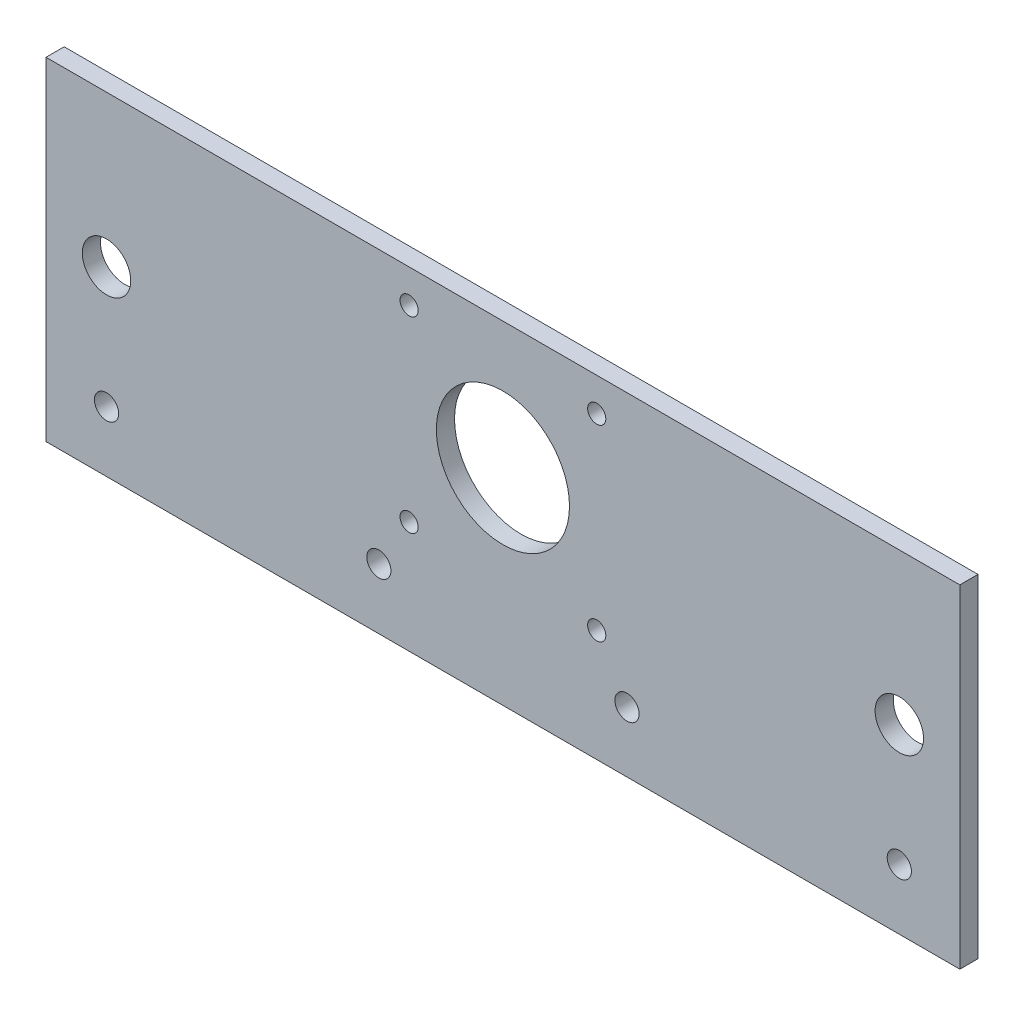
ISO-10303-21;
HEADER;
FILE_DESCRIPTION(('STEP AP214'),'2;1');
FILE_NAME('part.step','',(''),(''),'','','');
FILE_SCHEMA(('AUTOMOTIVE_DESIGN { 1 0 10303 214 1 1 1 1 }'));
ENDSEC;
DATA;
#1=APPLICATION_CONTEXT('core data for automotive mechanical design processes');
#2=APPLICATION_PROTOCOL_DEFINITION('international standard','automotive_design',2000,#1);
#3=PRODUCT_CONTEXT('',#1,'mechanical');
#4=PRODUCT('Part','Part','',(#3));
#5=PRODUCT_RELATED_PRODUCT_CATEGORY('part','',(#4));
#6=PRODUCT_DEFINITION_FORMATION('','',#4);
#7=PRODUCT_DEFINITION_CONTEXT('part definition',#1,'design');
#8=PRODUCT_DEFINITION('design','',#6,#7);
#9=PRODUCT_DEFINITION_SHAPE('','',#8);
#10=(LENGTH_UNIT() NAMED_UNIT(*) SI_UNIT(.MILLI.,.METRE.));
#11=(NAMED_UNIT(*) PLANE_ANGLE_UNIT() SI_UNIT($,.RADIAN.));
#12=(NAMED_UNIT(*) SI_UNIT($,.STERADIAN.) SOLID_ANGLE_UNIT());
#13=UNCERTAINTY_MEASURE_WITH_UNIT(LENGTH_MEASURE(1.E-05),#10,'distance_accuracy_value','');
#14=(GEOMETRIC_REPRESENTATION_CONTEXT(3) GLOBAL_UNCERTAINTY_ASSIGNED_CONTEXT((#13)) GLOBAL_UNIT_ASSIGNED_CONTEXT((#10,
#11,#12)) REPRESENTATION_CONTEXT('',''));
#15=CARTESIAN_POINT('',(0.,0.,0.));
#16=DIRECTION('',(0.,0.,1.));
#17=DIRECTION('',(1.,0.,0.));
#18=AXIS2_PLACEMENT_3D('',#15,#16,#17);
#19=CARTESIAN_POINT('',(0.,0.,3.));
#20=DIRECTION('',(1.,0.,0.));
#21=DIRECTION('',(0.,0.,-1.));
#22=AXIS2_PLACEMENT_3D('',#19,#20,#21);
#23=PLANE('',#22);
#24=DIRECTION('',(0.,-1.,0.));
#25=VECTOR('',#24,1.);
#26=CARTESIAN_POINT('',(0.,0.,0.));
#27=LINE('',#26,#25);
#28=CARTESIAN_POINT('',(0.,55.,0.));
#29=VERTEX_POINT('',#28);
#30=CARTESIAN_POINT('',(0.,0.,0.));
#31=VERTEX_POINT('',#30);
#32=EDGE_CURVE('E98',#29,#31,#27,.T.);
#33=ORIENTED_EDGE('',*,*,#32,.T.);
#34=DIRECTION('',(0.,0.,-1.));
#35=VECTOR('',#34,1.);
#36=CARTESIAN_POINT('',(0.,0.,3.));
#37=LINE('',#36,#35);
#38=CARTESIAN_POINT('',(0.,0.,3.));
#39=VERTEX_POINT('',#38);
#40=EDGE_CURVE('E11',#39,#31,#37,.T.);
#41=ORIENTED_EDGE('',*,*,#40,.F.);
#42=DIRECTION('',(0.,-1.,0.));
#43=VECTOR('',#42,1.);
#44=CARTESIAN_POINT('',(0.,0.,3.));
#45=LINE('',#44,#43);
#46=CARTESIAN_POINT('',(0.,55.,3.));
#47=VERTEX_POINT('',#46);
#48=EDGE_CURVE('E85',#47,#39,#45,.T.);
#49=ORIENTED_EDGE('',*,*,#48,.F.);
#50=DIRECTION('',(0.,0.,-1.));
#51=VECTOR('',#50,1.);
#52=CARTESIAN_POINT('',(0.,55.,3.));
#53=LINE('',#52,#51);
#54=EDGE_CURVE('E94',#47,#29,#53,.T.);
#55=ORIENTED_EDGE('',*,*,#54,.T.);
#56=EDGE_LOOP('',(#33,#41,#49,#55));
#57=FACE_BOUND('',#56,.T.);
#58=ADVANCED_FACE('F32',(#57),#23,.F.);
#59=CARTESIAN_POINT('',(0.,0.,3.));
#60=DIRECTION('',(0.,1.,0.));
#61=DIRECTION('',(0.,0.,1.));
#62=AXIS2_PLACEMENT_3D('',#59,#60,#61);
#63=PLANE('',#62);
#64=DIRECTION('',(1.,0.,0.));
#65=VECTOR('',#64,1.);
#66=CARTESIAN_POINT('',(0.,0.,0.));
#67=LINE('',#66,#65);
#68=CARTESIAN_POINT('',(151.,0.,0.));
#69=VERTEX_POINT('',#68);
#70=EDGE_CURVE('E89',#31,#69,#67,.T.);
#71=ORIENTED_EDGE('',*,*,#70,.T.);
#72=DIRECTION('',(0.,0.,-1.));
#73=VECTOR('',#72,1.);
#74=CARTESIAN_POINT('',(151.,0.,3.));
#75=LINE('',#74,#73);
#76=CARTESIAN_POINT('',(151.,0.,3.));
#77=VERTEX_POINT('',#76);
#78=EDGE_CURVE('E41',#77,#69,#75,.T.);
#79=ORIENTED_EDGE('',*,*,#78,.F.);
#80=DIRECTION('',(1.,0.,0.));
#81=VECTOR('',#80,1.);
#82=CARTESIAN_POINT('',(0.,0.,3.));
#83=LINE('',#82,#81);
#84=EDGE_CURVE('E80',#39,#77,#83,.T.);
#85=ORIENTED_EDGE('',*,*,#84,.F.);
#86=ORIENTED_EDGE('',*,*,#40,.T.);
#87=EDGE_LOOP('',(#71,#79,#85,#86));
#88=FACE_BOUND('',#87,.T.);
#89=ADVANCED_FACE('F88',(#88),#63,.F.);
#90=CARTESIAN_POINT('',(151.,0.,3.));
#91=DIRECTION('',(-1.,0.,0.));
#92=DIRECTION('',(0.,0.,1.));
#93=AXIS2_PLACEMENT_3D('',#90,#91,#92);
#94=PLANE('',#93);
#95=DIRECTION('',(0.,1.,0.));
#96=VECTOR('',#95,1.);
#97=CARTESIAN_POINT('',(151.,0.,0.));
#98=LINE('',#97,#96);
#99=CARTESIAN_POINT('',(151.,55.,0.));
#100=VERTEX_POINT('',#99);
#101=EDGE_CURVE('E67',#69,#100,#98,.T.);
#102=ORIENTED_EDGE('',*,*,#101,.T.);
#103=DIRECTION('',(0.,0.,-1.));
#104=VECTOR('',#103,1.);
#105=CARTESIAN_POINT('',(151.,55.,3.));
#106=LINE('',#105,#104);
#107=CARTESIAN_POINT('',(151.,55.,3.));
#108=VERTEX_POINT('',#107);
#109=EDGE_CURVE('E90',#108,#100,#106,.T.);
#110=ORIENTED_EDGE('',*,*,#109,.F.);
#111=DIRECTION('',(0.,1.,0.));
#112=VECTOR('',#111,1.);
#113=CARTESIAN_POINT('',(151.,0.,3.));
#114=LINE('',#113,#112);
#115=EDGE_CURVE('E83',#77,#108,#114,.T.);
#116=ORIENTED_EDGE('',*,*,#115,.F.);
#117=ORIENTED_EDGE('',*,*,#78,.T.);
#118=EDGE_LOOP('',(#102,#110,#116,#117));
#119=FACE_BOUND('',#118,.T.);
#120=ADVANCED_FACE('F92',(#119),#94,.F.);
#121=CARTESIAN_POINT('',(0.,55.,3.));
#122=DIRECTION('',(0.,-1.,0.));
#123=DIRECTION('',(0.,0.,-1.));
#124=AXIS2_PLACEMENT_3D('',#121,#122,#123);
#125=PLANE('',#124);
#126=DIRECTION('',(-1.,0.,0.));
#127=VECTOR('',#126,1.);
#128=CARTESIAN_POINT('',(0.,55.,0.));
#129=LINE('',#128,#127);
#130=EDGE_CURVE('E73',#100,#29,#129,.T.);
#131=ORIENTED_EDGE('',*,*,#130,.T.);
#132=ORIENTED_EDGE('',*,*,#54,.F.);
#133=DIRECTION('',(-1.,0.,0.));
#134=VECTOR('',#133,1.);
#135=CARTESIAN_POINT('',(0.,55.,3.));
#136=LINE('',#135,#134);
#137=EDGE_CURVE('E50',#108,#47,#136,.T.);
#138=ORIENTED_EDGE('',*,*,#137,.F.);
#139=ORIENTED_EDGE('',*,*,#109,.T.);
#140=EDGE_LOOP('',(#131,#132,#138,#139));
#141=FACE_BOUND('',#140,.T.);
#142=ADVANCED_FACE('F177',(#141),#125,.F.);
#143=CARTESIAN_POINT('',(0.,0.,3.));
#144=DIRECTION('',(0.,0.,-1.));
#145=DIRECTION('',(-1.,0.,0.));
#146=AXIS2_PLACEMENT_3D('',#143,#144,#145);
#147=PLANE('',#146);
#148=CARTESIAN_POINT('',(141.,10.,3.));
#149=DIRECTION('',(0.,0.,1.));
#150=DIRECTION('',(1.,0.,0.));
#151=AXIS2_PLACEMENT_3D('',#148,#149,#150);
#152=CIRCLE('',#151,2.);
#153=CARTESIAN_POINT('',(143.,10.,3.));
#154=VERTEX_POINT('',#153);
#155=EDGE_CURVE('E153',#154,#154,#152,.T.);
#156=ORIENTED_EDGE('',*,*,#155,.F.);
#157=EDGE_LOOP('',(#156));
#158=FACE_BOUND('',#157,.T.);
#159=CARTESIAN_POINT('',(96.,10.,3.));
#160=DIRECTION('',(0.,0.,1.));
#161=DIRECTION('',(1.,0.,0.));
#162=AXIS2_PLACEMENT_3D('',#159,#160,#161);
#163=CIRCLE('',#162,2.);
#164=CARTESIAN_POINT('',(98.,10.,3.));
#165=VERTEX_POINT('',#164);
#166=EDGE_CURVE('E143',#165,#165,#163,.T.);
#167=ORIENTED_EDGE('',*,*,#166,.F.);
#168=EDGE_LOOP('',(#167));
#169=FACE_BOUND('',#168,.T.);
#170=CARTESIAN_POINT('',(55.,10.,3.));
#171=DIRECTION('',(0.,0.,1.));
#172=DIRECTION('',(1.,0.,0.));
#173=AXIS2_PLACEMENT_3D('',#170,#171,#172);
#174=CIRCLE('',#173,2.);
#175=CARTESIAN_POINT('',(57.,10.,3.));
#176=VERTEX_POINT('',#175);
#177=EDGE_CURVE('E140',#176,#176,#174,.T.);
#178=ORIENTED_EDGE('',*,*,#177,.F.);
#179=EDGE_LOOP('',(#178));
#180=FACE_BOUND('',#179,.T.);
#181=CARTESIAN_POINT('',(10.,10.,3.));
#182=DIRECTION('',(0.,0.,1.));
#183=DIRECTION('',(1.,0.,0.));
#184=AXIS2_PLACEMENT_3D('',#181,#182,#183);
#185=CIRCLE('',#184,2.);
#186=CARTESIAN_POINT('',(12.,10.,3.));
#187=VERTEX_POINT('',#186);
#188=EDGE_CURVE('E137',#187,#187,#185,.T.);
#189=ORIENTED_EDGE('',*,*,#188,.F.);
#190=EDGE_LOOP('',(#189));
#191=FACE_BOUND('',#190,.T.);
#192=CARTESIAN_POINT('',(10.,30.,3.));
#193=DIRECTION('',(0.,0.,1.));
#194=DIRECTION('',(1.,0.,0.));
#195=AXIS2_PLACEMENT_3D('',#192,#193,#194);
#196=CIRCLE('',#195,4.);
#197=CARTESIAN_POINT('',(14.,30.,3.));
#198=VERTEX_POINT('',#197);
#199=EDGE_CURVE('E133',#198,#198,#196,.T.);
#200=ORIENTED_EDGE('',*,*,#199,.F.);
#201=EDGE_LOOP('',(#200));
#202=FACE_BOUND('',#201,.T.);
#203=CARTESIAN_POINT('',(141.,30.,3.));
#204=DIRECTION('',(0.,0.,1.));
#205=DIRECTION('',(1.,0.,0.));
#206=AXIS2_PLACEMENT_3D('',#203,#204,#205);
#207=CIRCLE('',#206,3.99999999999999);
#208=CARTESIAN_POINT('',(145.,30.,3.));
#209=VERTEX_POINT('',#208);
#210=EDGE_CURVE('E129',#209,#209,#207,.T.);
#211=ORIENTED_EDGE('',*,*,#210,.F.);
#212=EDGE_LOOP('',(#211));
#213=FACE_BOUND('',#212,.T.);
#214=CARTESIAN_POINT('',(60.,49.5,3.));
#215=DIRECTION('',(0.,0.,1.));
#216=DIRECTION('',(1.,0.,0.));
#217=AXIS2_PLACEMENT_3D('',#214,#215,#216);
#218=CIRCLE('',#217,1.5);
#219=CARTESIAN_POINT('',(61.5,49.5,3.));
#220=VERTEX_POINT('',#219);
#221=EDGE_CURVE('E125',#220,#220,#218,.T.);
#222=ORIENTED_EDGE('',*,*,#221,.F.);
#223=EDGE_LOOP('',(#222));
#224=FACE_BOUND('',#223,.T.);
#225=CARTESIAN_POINT('',(60.,18.5,3.));
#226=DIRECTION('',(0.,0.,1.));
#227=DIRECTION('',(1.,0.,0.));
#228=AXIS2_PLACEMENT_3D('',#225,#226,#227);
#229=CIRCLE('',#228,1.5);
#230=CARTESIAN_POINT('',(61.5,18.5,3.));
#231=VERTEX_POINT('',#230);
#232=EDGE_CURVE('E121',#231,#231,#229,.T.);
#233=ORIENTED_EDGE('',*,*,#232,.F.);
#234=EDGE_LOOP('',(#233));
#235=FACE_BOUND('',#234,.T.);
#236=CARTESIAN_POINT('',(91.,18.5,3.));
#237=DIRECTION('',(0.,0.,1.));
#238=DIRECTION('',(1.,0.,0.));
#239=AXIS2_PLACEMENT_3D('',#236,#237,#238);
#240=CIRCLE('',#239,1.5);
#241=CARTESIAN_POINT('',(92.5,18.5,3.));
#242=VERTEX_POINT('',#241);
#243=EDGE_CURVE('E117',#242,#242,#240,.T.);
#244=ORIENTED_EDGE('',*,*,#243,.F.);
#245=EDGE_LOOP('',(#244));
#246=FACE_BOUND('',#245,.T.);
#247=CARTESIAN_POINT('',(91.,49.5,3.));
#248=DIRECTION('',(0.,0.,1.));
#249=DIRECTION('',(1.,0.,0.));
#250=AXIS2_PLACEMENT_3D('',#247,#248,#249);
#251=CIRCLE('',#250,1.5);
#252=CARTESIAN_POINT('',(92.5,49.5,3.));
#253=VERTEX_POINT('',#252);
#254=EDGE_CURVE('E113',#253,#253,#251,.T.);
#255=ORIENTED_EDGE('',*,*,#254,.F.);
#256=EDGE_LOOP('',(#255));
#257=FACE_BOUND('',#256,.T.);
#258=CARTESIAN_POINT('',(75.5,34.,3.));
#259=DIRECTION('',(0.,0.,1.));
#260=DIRECTION('',(1.,0.,0.));
#261=AXIS2_PLACEMENT_3D('',#258,#259,#260);
#262=CIRCLE('',#261,11.);
#263=CARTESIAN_POINT('',(86.5,34.,3.));
#264=VERTEX_POINT('',#263);
#265=EDGE_CURVE('E109',#264,#264,#262,.T.);
#266=ORIENTED_EDGE('',*,*,#265,.F.);
#267=EDGE_LOOP('',(#266));
#268=FACE_BOUND('',#267,.T.);
#269=ORIENTED_EDGE('',*,*,#48,.T.);
#270=ORIENTED_EDGE('',*,*,#84,.T.);
#271=ORIENTED_EDGE('',*,*,#115,.T.);
#272=ORIENTED_EDGE('',*,*,#137,.T.);
#273=EDGE_LOOP('',(#269,#270,#271,#272));
#274=FACE_BOUND('',#273,.T.);
#275=ADVANCED_FACE('F81',(#158,#169,#180,#191,#202,#213,#224,#235,#246,#257,#268,#274),#147,.F.);
#276=CARTESIAN_POINT('',(0.,0.,0.));
#277=DIRECTION('',(0.,0.,-1.));
#278=DIRECTION('',(-1.,0.,0.));
#279=AXIS2_PLACEMENT_3D('',#276,#277,#278);
#280=PLANE('',#279);
#281=CARTESIAN_POINT('',(141.,10.,0.));
#282=DIRECTION('',(0.,0.,-1.));
#283=DIRECTION('',(-1.,0.,0.));
#284=AXIS2_PLACEMENT_3D('',#281,#282,#283);
#285=CIRCLE('',#284,2.);
#286=CARTESIAN_POINT('',(139.,10.,0.));
#287=VERTEX_POINT('',#286);
#288=EDGE_CURVE('E35',#287,#287,#285,.T.);
#289=ORIENTED_EDGE('',*,*,#288,.F.);
#290=EDGE_LOOP('',(#289));
#291=FACE_BOUND('',#290,.T.);
#292=CARTESIAN_POINT('',(96.,10.,0.));
#293=DIRECTION('',(0.,0.,-1.));
#294=DIRECTION('',(-1.,0.,0.));
#295=AXIS2_PLACEMENT_3D('',#292,#293,#294);
#296=CIRCLE('',#295,2.);
#297=CARTESIAN_POINT('',(94.,10.,0.));
#298=VERTEX_POINT('',#297);
#299=EDGE_CURVE('E141',#298,#298,#296,.T.);
#300=ORIENTED_EDGE('',*,*,#299,.F.);
#301=EDGE_LOOP('',(#300));
#302=FACE_BOUND('',#301,.T.);
#303=CARTESIAN_POINT('',(55.,10.,0.));
#304=DIRECTION('',(0.,0.,-1.));
#305=DIRECTION('',(-1.,0.,0.));
#306=AXIS2_PLACEMENT_3D('',#303,#304,#305);
#307=CIRCLE('',#306,2.);
#308=CARTESIAN_POINT('',(53.,10.,0.));
#309=VERTEX_POINT('',#308);
#310=EDGE_CURVE('E138',#309,#309,#307,.T.);
#311=ORIENTED_EDGE('',*,*,#310,.F.);
#312=EDGE_LOOP('',(#311));
#313=FACE_BOUND('',#312,.T.);
#314=CARTESIAN_POINT('',(10.,10.,0.));
#315=DIRECTION('',(0.,0.,-1.));
#316=DIRECTION('',(-1.,0.,0.));
#317=AXIS2_PLACEMENT_3D('',#314,#315,#316);
#318=CIRCLE('',#317,2.);
#319=CARTESIAN_POINT('',(8.,10.,0.));
#320=VERTEX_POINT('',#319);
#321=EDGE_CURVE('E134',#320,#320,#318,.T.);
#322=ORIENTED_EDGE('',*,*,#321,.F.);
#323=EDGE_LOOP('',(#322));
#324=FACE_BOUND('',#323,.T.);
#325=CARTESIAN_POINT('',(10.,30.,0.));
#326=DIRECTION('',(0.,0.,-1.));
#327=DIRECTION('',(-1.,0.,0.));
#328=AXIS2_PLACEMENT_3D('',#325,#326,#327);
#329=CIRCLE('',#328,4.);
#330=CARTESIAN_POINT('',(6.,30.,0.));
#331=VERTEX_POINT('',#330);
#332=EDGE_CURVE('E130',#331,#331,#329,.T.);
#333=ORIENTED_EDGE('',*,*,#332,.F.);
#334=EDGE_LOOP('',(#333));
#335=FACE_BOUND('',#334,.T.);
#336=CARTESIAN_POINT('',(141.,30.,0.));
#337=DIRECTION('',(0.,0.,-1.));
#338=DIRECTION('',(-1.,0.,0.));
#339=AXIS2_PLACEMENT_3D('',#336,#337,#338);
#340=CIRCLE('',#339,3.99999999999999);
#341=CARTESIAN_POINT('',(137.,30.,0.));
#342=VERTEX_POINT('',#341);
#343=EDGE_CURVE('E126',#342,#342,#340,.T.);
#344=ORIENTED_EDGE('',*,*,#343,.F.);
#345=EDGE_LOOP('',(#344));
#346=FACE_BOUND('',#345,.T.);
#347=CARTESIAN_POINT('',(60.,49.5,0.));
#348=DIRECTION('',(0.,0.,-1.));
#349=DIRECTION('',(-1.,0.,0.));
#350=AXIS2_PLACEMENT_3D('',#347,#348,#349);
#351=CIRCLE('',#350,1.5);
#352=CARTESIAN_POINT('',(58.5,49.5,0.));
#353=VERTEX_POINT('',#352);
#354=EDGE_CURVE('E122',#353,#353,#351,.T.);
#355=ORIENTED_EDGE('',*,*,#354,.F.);
#356=EDGE_LOOP('',(#355));
#357=FACE_BOUND('',#356,.T.);
#358=CARTESIAN_POINT('',(60.,18.5,0.));
#359=DIRECTION('',(0.,0.,-1.));
#360=DIRECTION('',(-1.,0.,0.));
#361=AXIS2_PLACEMENT_3D('',#358,#359,#360);
#362=CIRCLE('',#361,1.5);
#363=CARTESIAN_POINT('',(58.5,18.5,0.));
#364=VERTEX_POINT('',#363);
#365=EDGE_CURVE('E118',#364,#364,#362,.T.);
#366=ORIENTED_EDGE('',*,*,#365,.F.);
#367=EDGE_LOOP('',(#366));
#368=FACE_BOUND('',#367,.T.);
#369=CARTESIAN_POINT('',(91.,18.5,0.));
#370=DIRECTION('',(0.,0.,-1.));
#371=DIRECTION('',(-1.,0.,0.));
#372=AXIS2_PLACEMENT_3D('',#369,#370,#371);
#373=CIRCLE('',#372,1.5);
#374=CARTESIAN_POINT('',(89.5,18.5,0.));
#375=VERTEX_POINT('',#374);
#376=EDGE_CURVE('E114',#375,#375,#373,.T.);
#377=ORIENTED_EDGE('',*,*,#376,.F.);
#378=EDGE_LOOP('',(#377));
#379=FACE_BOUND('',#378,.T.);
#380=CARTESIAN_POINT('',(91.,49.5,0.));
#381=DIRECTION('',(0.,0.,-1.));
#382=DIRECTION('',(-1.,0.,0.));
#383=AXIS2_PLACEMENT_3D('',#380,#381,#382);
#384=CIRCLE('',#383,1.5);
#385=CARTESIAN_POINT('',(89.5,49.5,0.));
#386=VERTEX_POINT('',#385);
#387=EDGE_CURVE('E110',#386,#386,#384,.T.);
#388=ORIENTED_EDGE('',*,*,#387,.F.);
#389=EDGE_LOOP('',(#388));
#390=FACE_BOUND('',#389,.T.);
#391=CARTESIAN_POINT('',(75.5,34.,0.));
#392=DIRECTION('',(0.,0.,-1.));
#393=DIRECTION('',(-1.,0.,0.));
#394=AXIS2_PLACEMENT_3D('',#391,#392,#393);
#395=CIRCLE('',#394,11.);
#396=CARTESIAN_POINT('',(64.5,34.,0.));
#397=VERTEX_POINT('',#396);
#398=EDGE_CURVE('E101',#397,#397,#395,.T.);
#399=ORIENTED_EDGE('',*,*,#398,.F.);
#400=EDGE_LOOP('',(#399));
#401=FACE_BOUND('',#400,.T.);
#402=ORIENTED_EDGE('',*,*,#32,.F.);
#403=ORIENTED_EDGE('',*,*,#130,.F.);
#404=ORIENTED_EDGE('',*,*,#101,.F.);
#405=ORIENTED_EDGE('',*,*,#70,.F.);
#406=EDGE_LOOP('',(#402,#403,#404,#405));
#407=FACE_BOUND('',#406,.T.);
#408=ADVANCED_FACE('F176',(#291,#302,#313,#324,#335,#346,#357,#368,#379,#390,#401,#407),#280,.T.);
#409=CARTESIAN_POINT('',(75.5,34.,-14.));
#410=DIRECTION('',(0.,0.,1.));
#411=DIRECTION('',(1.,0.,0.));
#412=AXIS2_PLACEMENT_3D('',#409,#410,#411);
#413=CYLINDRICAL_SURFACE('',#412,11.);
#414=ORIENTED_EDGE('',*,*,#398,.T.);
#415=EDGE_LOOP('',(#414));
#416=FACE_BOUND('',#415,.T.);
#417=ORIENTED_EDGE('',*,*,#265,.T.);
#418=EDGE_LOOP('',(#417));
#419=FACE_BOUND('',#418,.T.);
#420=ADVANCED_FACE('F173',(#416,#419),#413,.F.);
#421=CARTESIAN_POINT('',(91.,49.5,-7.));
#422=DIRECTION('',(0.,0.,1.));
#423=DIRECTION('',(1.,0.,0.));
#424=AXIS2_PLACEMENT_3D('',#421,#422,#423);
#425=CYLINDRICAL_SURFACE('',#424,1.5);
#426=ORIENTED_EDGE('',*,*,#387,.T.);
#427=EDGE_LOOP('',(#426));
#428=FACE_BOUND('',#427,.T.);
#429=ORIENTED_EDGE('',*,*,#254,.T.);
#430=EDGE_LOOP('',(#429));
#431=FACE_BOUND('',#430,.T.);
#432=ADVANCED_FACE('F226',(#428,#431),#425,.F.);
#433=CARTESIAN_POINT('',(91.,18.5,-7.));
#434=DIRECTION('',(0.,0.,1.));
#435=DIRECTION('',(1.,0.,0.));
#436=AXIS2_PLACEMENT_3D('',#433,#434,#435);
#437=CYLINDRICAL_SURFACE('',#436,1.5);
#438=ORIENTED_EDGE('',*,*,#376,.T.);
#439=EDGE_LOOP('',(#438));
#440=FACE_BOUND('',#439,.T.);
#441=ORIENTED_EDGE('',*,*,#243,.T.);
#442=EDGE_LOOP('',(#441));
#443=FACE_BOUND('',#442,.T.);
#444=ADVANCED_FACE('F232',(#440,#443),#437,.F.);
#445=CARTESIAN_POINT('',(60.,18.5,-7.));
#446=DIRECTION('',(0.,0.,1.));
#447=DIRECTION('',(1.,0.,0.));
#448=AXIS2_PLACEMENT_3D('',#445,#446,#447);
#449=CYLINDRICAL_SURFACE('',#448,1.5);
#450=ORIENTED_EDGE('',*,*,#365,.T.);
#451=EDGE_LOOP('',(#450));
#452=FACE_BOUND('',#451,.T.);
#453=ORIENTED_EDGE('',*,*,#232,.T.);
#454=EDGE_LOOP('',(#453));
#455=FACE_BOUND('',#454,.T.);
#456=ADVANCED_FACE('F240',(#452,#455),#449,.F.);
#457=CARTESIAN_POINT('',(60.,49.5,-7.));
#458=DIRECTION('',(0.,0.,1.));
#459=DIRECTION('',(1.,0.,0.));
#460=AXIS2_PLACEMENT_3D('',#457,#458,#459);
#461=CYLINDRICAL_SURFACE('',#460,1.5);
#462=ORIENTED_EDGE('',*,*,#354,.T.);
#463=EDGE_LOOP('',(#462));
#464=FACE_BOUND('',#463,.T.);
#465=ORIENTED_EDGE('',*,*,#221,.T.);
#466=EDGE_LOOP('',(#465));
#467=FACE_BOUND('',#466,.T.);
#468=ADVANCED_FACE('F248',(#464,#467),#461,.F.);
#469=CARTESIAN_POINT('',(141.,30.,-7.));
#470=DIRECTION('',(0.,0.,1.));
#471=DIRECTION('',(1.,0.,0.));
#472=AXIS2_PLACEMENT_3D('',#469,#470,#471);
#473=CYLINDRICAL_SURFACE('',#472,3.99999999999999);
#474=ORIENTED_EDGE('',*,*,#343,.T.);
#475=EDGE_LOOP('',(#474));
#476=FACE_BOUND('',#475,.T.);
#477=ORIENTED_EDGE('',*,*,#210,.T.);
#478=EDGE_LOOP('',(#477));
#479=FACE_BOUND('',#478,.T.);
#480=ADVANCED_FACE('F256',(#476,#479),#473,.F.);
#481=CARTESIAN_POINT('',(10.,30.,-7.));
#482=DIRECTION('',(0.,0.,1.));
#483=DIRECTION('',(1.,0.,0.));
#484=AXIS2_PLACEMENT_3D('',#481,#482,#483);
#485=CYLINDRICAL_SURFACE('',#484,4.);
#486=ORIENTED_EDGE('',*,*,#332,.T.);
#487=EDGE_LOOP('',(#486));
#488=FACE_BOUND('',#487,.T.);
#489=ORIENTED_EDGE('',*,*,#199,.T.);
#490=EDGE_LOOP('',(#489));
#491=FACE_BOUND('',#490,.T.);
#492=ADVANCED_FACE('F264',(#488,#491),#485,.F.);
#493=CARTESIAN_POINT('',(10.,10.,-7.));
#494=DIRECTION('',(0.,0.,1.));
#495=DIRECTION('',(1.,0.,0.));
#496=AXIS2_PLACEMENT_3D('',#493,#494,#495);
#497=CYLINDRICAL_SURFACE('',#496,2.);
#498=ORIENTED_EDGE('',*,*,#321,.T.);
#499=EDGE_LOOP('',(#498));
#500=FACE_BOUND('',#499,.T.);
#501=ORIENTED_EDGE('',*,*,#188,.T.);
#502=EDGE_LOOP('',(#501));
#503=FACE_BOUND('',#502,.T.);
#504=ADVANCED_FACE('F271',(#500,#503),#497,.F.);
#505=CARTESIAN_POINT('',(55.,10.,-7.));
#506=DIRECTION('',(0.,0.,1.));
#507=DIRECTION('',(1.,0.,0.));
#508=AXIS2_PLACEMENT_3D('',#505,#506,#507);
#509=CYLINDRICAL_SURFACE('',#508,2.);
#510=ORIENTED_EDGE('',*,*,#310,.T.);
#511=EDGE_LOOP('',(#510));
#512=FACE_BOUND('',#511,.T.);
#513=ORIENTED_EDGE('',*,*,#177,.T.);
#514=EDGE_LOOP('',(#513));
#515=FACE_BOUND('',#514,.T.);
#516=ADVANCED_FACE('F278',(#512,#515),#509,.F.);
#517=CARTESIAN_POINT('',(96.,10.,-7.));
#518=DIRECTION('',(0.,0.,1.));
#519=DIRECTION('',(1.,0.,0.));
#520=AXIS2_PLACEMENT_3D('',#517,#518,#519);
#521=CYLINDRICAL_SURFACE('',#520,2.);
#522=ORIENTED_EDGE('',*,*,#299,.T.);
#523=EDGE_LOOP('',(#522));
#524=FACE_BOUND('',#523,.T.);
#525=ORIENTED_EDGE('',*,*,#166,.T.);
#526=EDGE_LOOP('',(#525));
#527=FACE_BOUND('',#526,.T.);
#528=ADVANCED_FACE('F286',(#524,#527),#521,.F.);
#529=CARTESIAN_POINT('',(141.,10.,-7.));
#530=DIRECTION('',(0.,0.,1.));
#531=DIRECTION('',(1.,0.,0.));
#532=AXIS2_PLACEMENT_3D('',#529,#530,#531);
#533=CYLINDRICAL_SURFACE('',#532,2.);
#534=ORIENTED_EDGE('',*,*,#288,.T.);
#535=EDGE_LOOP('',(#534));
#536=FACE_BOUND('',#535,.T.);
#537=ORIENTED_EDGE('',*,*,#155,.T.);
#538=EDGE_LOOP('',(#537));
#539=FACE_BOUND('',#538,.T.);
#540=ADVANCED_FACE('F294',(#536,#539),#533,.F.);
#541=CLOSED_SHELL('',(#58,#89,#120,#142,#275,#408,#420,#432,#444,#456,#468,#480,#492,#504,#516,
#528,#540));
#542=MANIFOLD_SOLID_BREP('B2',#541);
#543=ADVANCED_BREP_SHAPE_REPRESENTATION('',(#18,#542),#14);
#544=SHAPE_DEFINITION_REPRESENTATION(#9,#543);
ENDSEC;
END-ISO-10303-21;
